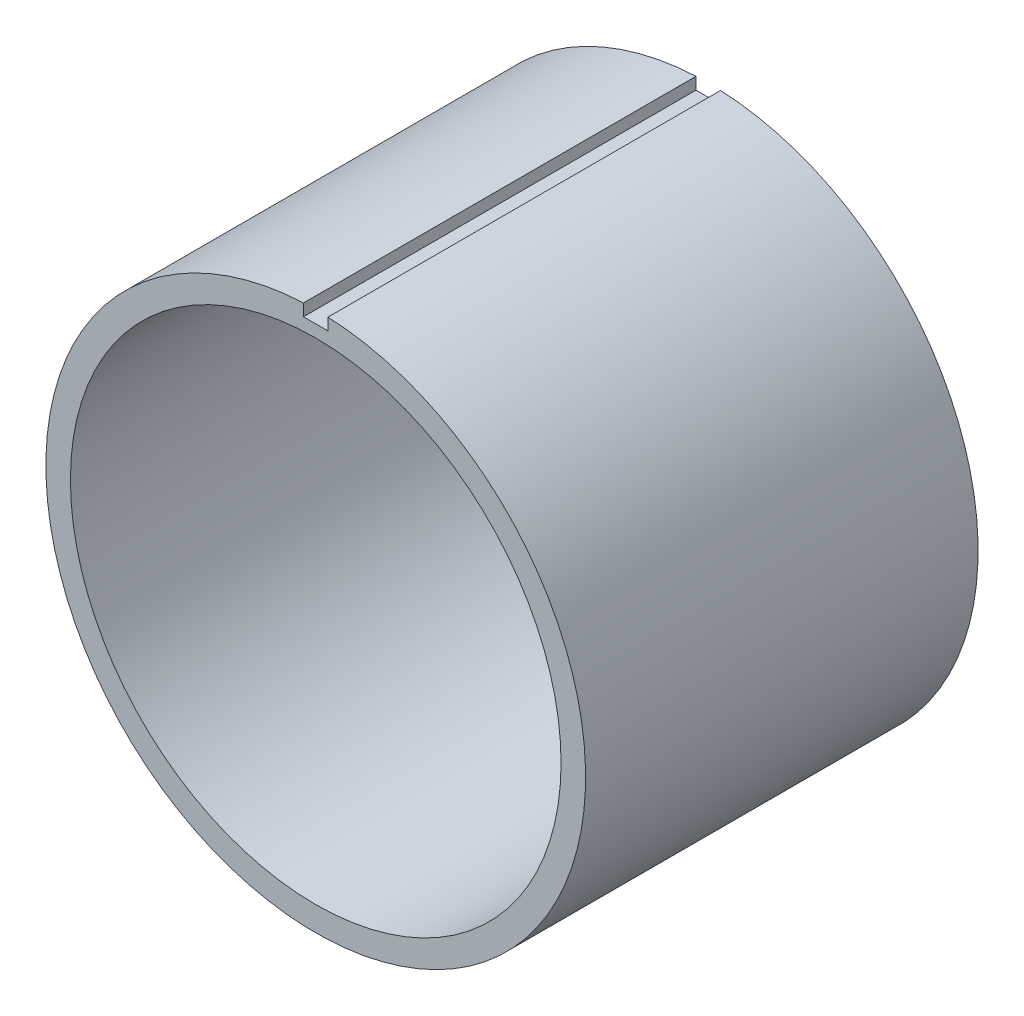
ISO-10303-21;
HEADER;
FILE_DESCRIPTION(('STEP AP214'),'2;1');
FILE_NAME('part.step','',(''),(''),'','','');
FILE_SCHEMA(('AUTOMOTIVE_DESIGN { 1 0 10303 214 1 1 1 1 }'));
ENDSEC;
DATA;
#1=APPLICATION_CONTEXT('core data for automotive mechanical design processes');
#2=APPLICATION_PROTOCOL_DEFINITION('international standard','automotive_design',2000,#1);
#3=PRODUCT_CONTEXT('',#1,'mechanical');
#4=PRODUCT('Part','Part','',(#3));
#5=PRODUCT_RELATED_PRODUCT_CATEGORY('part','',(#4));
#6=PRODUCT_DEFINITION_FORMATION('','',#4);
#7=PRODUCT_DEFINITION_CONTEXT('part definition',#1,'design');
#8=PRODUCT_DEFINITION('design','',#6,#7);
#9=PRODUCT_DEFINITION_SHAPE('','',#8);
#10=(LENGTH_UNIT() NAMED_UNIT(*) SI_UNIT(.MILLI.,.METRE.));
#11=(NAMED_UNIT(*) PLANE_ANGLE_UNIT() SI_UNIT($,.RADIAN.));
#12=(NAMED_UNIT(*) SI_UNIT($,.STERADIAN.) SOLID_ANGLE_UNIT());
#13=UNCERTAINTY_MEASURE_WITH_UNIT(LENGTH_MEASURE(1.E-05),#10,'distance_accuracy_value','');
#14=(GEOMETRIC_REPRESENTATION_CONTEXT(3) GLOBAL_UNCERTAINTY_ASSIGNED_CONTEXT((#13)) GLOBAL_UNIT_ASSIGNED_CONTEXT((#10,
#11,#12)) REPRESENTATION_CONTEXT('',''));
#15=CARTESIAN_POINT('',(0.,0.,0.));
#16=DIRECTION('',(0.,0.,1.));
#17=DIRECTION('',(1.,0.,0.));
#18=AXIS2_PLACEMENT_3D('',#15,#16,#17);
#19=CARTESIAN_POINT('',(-242.141421356237,-2.53629676207876E-12,-10.));
#20=DIRECTION('',(0.,-1.,0.));
#21=DIRECTION('',(1.,0.,0.));
#22=AXIS2_PLACEMENT_3D('',#19,#20,#21);
#23=PLANE('',#22);
#24=DIRECTION('',(1.,0.,0.));
#25=VECTOR('',#24,1.);
#26=CARTESIAN_POINT('',(-242.141421356237,-2.53629676207876E-12,0.));
#27=LINE('',#26,#25);
#28=CARTESIAN_POINT('',(45.,4.71349980743823E-13,0.));
#29=VERTEX_POINT('',#28);
#30=CARTESIAN_POINT('',(100.,1.04744440165294E-12,0.));
#31=VERTEX_POINT('',#30);
#32=EDGE_CURVE('E243',#29,#31,#27,.T.);
#33=ORIENTED_EDGE('',*,*,#32,.F.);
#34=DIRECTION('',(0.,0.,1.));
#35=VECTOR('',#34,1.);
#36=CARTESIAN_POINT('',(45.,4.71349980743823E-13,-10.));
#37=LINE('',#36,#35);
#38=CARTESIAN_POINT('',(45.,4.71349980743823E-13,-10.));
#39=VERTEX_POINT('',#38);
#40=EDGE_CURVE('E13',#39,#29,#37,.T.);
#41=ORIENTED_EDGE('',*,*,#40,.F.);
#42=DIRECTION('',(1.,0.,0.));
#43=VECTOR('',#42,1.);
#44=CARTESIAN_POINT('',(-242.141421356237,-2.53629676207876E-12,-10.));
#45=LINE('',#44,#43);
#46=CARTESIAN_POINT('',(100.,1.04744440165294E-12,-10.));
#47=VERTEX_POINT('',#46);
#48=EDGE_CURVE('E336',#39,#47,#45,.T.);
#49=ORIENTED_EDGE('',*,*,#48,.T.);
#50=DIRECTION('',(0.,0.,1.));
#51=VECTOR('',#50,1.);
#52=CARTESIAN_POINT('',(100.,1.04744440165294E-12,-10.));
#53=LINE('',#52,#51);
#54=EDGE_CURVE('E114',#47,#31,#53,.T.);
#55=ORIENTED_EDGE('',*,*,#54,.T.);
#56=EDGE_LOOP('',(#33,#41,#49,#55));
#57=FACE_BOUND('',#56,.T.);
#58=ADVANCED_FACE('F97',(#57),#23,.T.);
#59=CARTESIAN_POINT('',(0.,0.,-10.));
#60=DIRECTION('',(0.,0.,1.));
#61=DIRECTION('',(1.,0.,0.));
#62=AXIS2_PLACEMENT_3D('',#59,#60,#61);
#63=CYLINDRICAL_SURFACE('',#62,45.);
#64=CARTESIAN_POINT('',(0.,0.,0.));
#65=DIRECTION('',(0.,0.,-1.));
#66=DIRECTION('',(-1.,0.,0.));
#67=AXIS2_PLACEMENT_3D('',#64,#65,#66);
#68=CIRCLE('',#67,45.);
#69=CARTESIAN_POINT('',(5.00000000000032,-44.7213595499958,0.));
#70=VERTEX_POINT('',#69);
#71=EDGE_CURVE('E245',#29,#70,#68,.T.);
#72=ORIENTED_EDGE('',*,*,#71,.T.);
#73=DIRECTION('',(0.,0.,1.));
#74=VECTOR('',#73,1.);
#75=CARTESIAN_POINT('',(5.00000000000032,-44.7213595499958,-10.));
#76=LINE('',#75,#74);
#77=CARTESIAN_POINT('',(5.00000000000032,-44.7213595499958,-10.));
#78=VERTEX_POINT('',#77);
#79=EDGE_CURVE('E106',#78,#70,#76,.T.);
#80=ORIENTED_EDGE('',*,*,#79,.F.);
#81=CARTESIAN_POINT('',(0.,0.,-10.));
#82=DIRECTION('',(0.,0.,-1.));
#83=DIRECTION('',(-1.,0.,0.));
#84=AXIS2_PLACEMENT_3D('',#81,#82,#83);
#85=CIRCLE('',#84,45.);
#86=EDGE_CURVE('E332',#39,#78,#85,.T.);
#87=ORIENTED_EDGE('',*,*,#86,.F.);
#88=ORIENTED_EDGE('',*,*,#40,.T.);
#89=EDGE_LOOP('',(#72,#80,#87,#88));
#90=FACE_BOUND('',#89,.T.);
#91=ADVANCED_FACE('F319',(#90),#63,.T.);
#92=CARTESIAN_POINT('',(5.,1.77049406241722E-12,-10.));
#93=DIRECTION('',(1.,0.,0.));
#94=DIRECTION('',(0.,1.,0.));
#95=AXIS2_PLACEMENT_3D('',#92,#93,#94);
#96=PLANE('',#95);
#97=DIRECTION('',(0.,1.,0.));
#98=VECTOR('',#97,1.);
#99=CARTESIAN_POINT('',(5.,1.77049406241722E-12,0.));
#100=LINE('',#99,#98);
#101=CARTESIAN_POINT('',(5.00000000000071,-99.8749217771909,0.));
#102=VERTEX_POINT('',#101);
#103=EDGE_CURVE('E248',#102,#70,#100,.T.);
#104=ORIENTED_EDGE('',*,*,#103,.F.);
#105=DIRECTION('',(0.,0.,1.));
#106=VECTOR('',#105,1.);
#107=CARTESIAN_POINT('',(5.00000000000071,-99.8749217771909,-10.));
#108=LINE('',#107,#106);
#109=CARTESIAN_POINT('',(5.00000000000071,-99.8749217771909,-10.));
#110=VERTEX_POINT('',#109);
#111=EDGE_CURVE('E309',#110,#102,#108,.T.);
#112=ORIENTED_EDGE('',*,*,#111,.F.);
#113=DIRECTION('',(0.,1.,0.));
#114=VECTOR('',#113,1.);
#115=CARTESIAN_POINT('',(5.,1.77049406241722E-12,-10.));
#116=LINE('',#115,#114);
#117=EDGE_CURVE('E316',#110,#78,#116,.T.);
#118=ORIENTED_EDGE('',*,*,#117,.T.);
#119=ORIENTED_EDGE('',*,*,#79,.T.);
#120=EDGE_LOOP('',(#104,#112,#118,#119));
#121=FACE_BOUND('',#120,.T.);
#122=ADVANCED_FACE('F314',(#121),#96,.T.);
#123=CARTESIAN_POINT('',(-239.489988262978,-105.990996422503,-10.));
#124=DIRECTION('',(0.02500782105754,-0.999687255538428,0.));
#125=DIRECTION('',(0.999687255538428,0.02500782105754,0.));
#126=AXIS2_PLACEMENT_3D('',#123,#124,#125);
#127=PLANE('',#126);
#128=DIRECTION('',(0.999687255538428,0.02500782105754,0.));
#129=VECTOR('',#128,1.);
#130=CARTESIAN_POINT('',(-239.489988262978,-105.990996422503,0.));
#131=LINE('',#130,#129);
#132=CARTESIAN_POINT('',(6.98296267768639E-13,-100.,0.));
#133=VERTEX_POINT('',#132);
#134=EDGE_CURVE('E251',#133,#102,#131,.T.);
#135=ORIENTED_EDGE('',*,*,#134,.F.);
#136=DIRECTION('',(0.,0.,1.));
#137=VECTOR('',#136,1.);
#138=CARTESIAN_POINT('',(6.98296267768639E-13,-100.,-10.));
#139=LINE('',#138,#137);
#140=CARTESIAN_POINT('',(6.98296267768639E-13,-100.,-10.));
#141=VERTEX_POINT('',#140);
#142=EDGE_CURVE('E307',#141,#133,#139,.T.);
#143=ORIENTED_EDGE('',*,*,#142,.F.);
#144=DIRECTION('',(0.999687255538428,0.02500782105754,0.));
#145=VECTOR('',#144,1.);
#146=CARTESIAN_POINT('',(-239.489988262978,-105.990996422503,-10.));
#147=LINE('',#146,#145);
#148=EDGE_CURVE('E329',#141,#110,#147,.T.);
#149=ORIENTED_EDGE('',*,*,#148,.T.);
#150=ORIENTED_EDGE('',*,*,#111,.T.);
#151=EDGE_LOOP('',(#135,#143,#149,#150));
#152=FACE_BOUND('',#151,.T.);
#153=ADVANCED_FACE('F326',(#152),#127,.T.);
#154=CARTESIAN_POINT('',(0.,1.71424690635048E-12,-10.));
#155=DIRECTION('',(-1.,0.,0.));
#156=DIRECTION('',(0.,-1.,0.));
#157=AXIS2_PLACEMENT_3D('',#154,#155,#156);
#158=PLANE('',#157);
#159=DIRECTION('',(0.,-1.,0.));
#160=VECTOR('',#159,1.);
#161=CARTESIAN_POINT('',(0.,1.71424690635048E-12,0.));
#162=LINE('',#161,#160);
#163=CARTESIAN_POINT('',(3.14233320495894E-13,-45.,0.));
#164=VERTEX_POINT('',#163);
#165=EDGE_CURVE('E254',#164,#133,#162,.T.);
#166=ORIENTED_EDGE('',*,*,#165,.F.);
#167=DIRECTION('',(0.,0.,1.));
#168=VECTOR('',#167,1.);
#169=CARTESIAN_POINT('',(3.14233320495894E-13,-45.,-10.));
#170=LINE('',#169,#168);
#171=CARTESIAN_POINT('',(3.14233320495894E-13,-45.,-10.));
#172=VERTEX_POINT('',#171);
#173=EDGE_CURVE('E305',#172,#164,#170,.T.);
#174=ORIENTED_EDGE('',*,*,#173,.F.);
#175=DIRECTION('',(0.,-1.,0.));
#176=VECTOR('',#175,1.);
#177=CARTESIAN_POINT('',(0.,1.71424690635048E-12,-10.));
#178=LINE('',#177,#176);
#179=EDGE_CURVE('E334',#172,#141,#178,.T.);
#180=ORIENTED_EDGE('',*,*,#179,.T.);
#181=ORIENTED_EDGE('',*,*,#142,.T.);
#182=EDGE_LOOP('',(#166,#174,#180,#181));
#183=FACE_BOUND('',#182,.T.);
#184=ADVANCED_FACE('F385',(#183),#158,.T.);
#185=CARTESIAN_POINT('',(0.,0.,-10.));
#186=DIRECTION('',(0.,0.,1.));
#187=DIRECTION('',(1.,0.,0.));
#188=AXIS2_PLACEMENT_3D('',#185,#186,#187);
#189=CYLINDRICAL_SURFACE('',#188,45.);
#190=CARTESIAN_POINT('',(0.,0.,0.));
#191=DIRECTION('',(0.,0.,-1.));
#192=DIRECTION('',(-1.,0.,0.));
#193=AXIS2_PLACEMENT_3D('',#190,#191,#192);
#194=CIRCLE('',#193,45.);
#195=CARTESIAN_POINT('',(-44.7213595499958,-5.00000000000015,0.));
#196=VERTEX_POINT('',#195);
#197=EDGE_CURVE('E257',#164,#196,#194,.T.);
#198=ORIENTED_EDGE('',*,*,#197,.T.);
#199=DIRECTION('',(0.,0.,1.));
#200=VECTOR('',#199,1.);
#201=CARTESIAN_POINT('',(-44.7213595499958,-5.00000000000015,-10.));
#202=LINE('',#201,#200);
#203=CARTESIAN_POINT('',(-44.7213595499958,-5.00000000000015,-10.));
#204=VERTEX_POINT('',#203);
#205=EDGE_CURVE('E303',#204,#196,#202,.T.);
#206=ORIENTED_EDGE('',*,*,#205,.F.);
#207=CARTESIAN_POINT('',(0.,0.,-10.));
#208=DIRECTION('',(0.,0.,-1.));
#209=DIRECTION('',(-1.,0.,0.));
#210=AXIS2_PLACEMENT_3D('',#207,#208,#209);
#211=CIRCLE('',#210,45.);
#212=EDGE_CURVE('E341',#172,#204,#211,.T.);
#213=ORIENTED_EDGE('',*,*,#212,.F.);
#214=ORIENTED_EDGE('',*,*,#173,.T.);
#215=EDGE_LOOP('',(#198,#206,#213,#214));
#216=FACE_BOUND('',#215,.T.);
#217=ADVANCED_FACE('F388',(#216),#189,.T.);
#218=CARTESIAN_POINT('',(-242.141421356237,-5.00000000000086,-10.));
#219=DIRECTION('',(0.,-1.,0.));
#220=DIRECTION('',(1.,0.,0.));
#221=AXIS2_PLACEMENT_3D('',#218,#219,#220);
#222=PLANE('',#221);
#223=DIRECTION('',(1.,0.,0.));
#224=VECTOR('',#223,1.);
#225=CARTESIAN_POINT('',(-242.141421356237,-5.00000000000086,0.));
#226=LINE('',#225,#224);
#227=CARTESIAN_POINT('',(-99.8749217771909,-5.00000000000035,0.));
#228=VERTEX_POINT('',#227);
#229=EDGE_CURVE('E260',#228,#196,#226,.T.);
#230=ORIENTED_EDGE('',*,*,#229,.F.);
#231=DIRECTION('',(0.,0.,1.));
#232=VECTOR('',#231,1.);
#233=CARTESIAN_POINT('',(-99.8749217771909,-5.00000000000035,-10.));
#234=LINE('',#233,#232);
#235=CARTESIAN_POINT('',(-99.8749217771909,-5.00000000000035,-10.));
#236=VERTEX_POINT('',#235);
#237=EDGE_CURVE('E301',#236,#228,#234,.T.);
#238=ORIENTED_EDGE('',*,*,#237,.F.);
#239=DIRECTION('',(1.,0.,0.));
#240=VECTOR('',#239,1.);
#241=CARTESIAN_POINT('',(-242.141421356237,-5.00000000000086,-10.));
#242=LINE('',#241,#240);
#243=EDGE_CURVE('E343',#236,#204,#242,.T.);
#244=ORIENTED_EDGE('',*,*,#243,.T.);
#245=ORIENTED_EDGE('',*,*,#205,.T.);
#246=EDGE_LOOP('',(#230,#238,#244,#245));
#247=FACE_BOUND('',#246,.T.);
#248=ADVANCED_FACE('F392',(#247),#222,.T.);
#249=CARTESIAN_POINT('',(-100.088893981854,3.55353553390634,-10.));
#250=DIRECTION('',(-0.999687255538428,-0.0250078210575345,0.));
#251=DIRECTION('',(0.0250078210575345,-0.999687255538428,0.));
#252=AXIS2_PLACEMENT_3D('',#249,#250,#251);
#253=PLANE('',#252);
#254=DIRECTION('',(0.0250078210575345,-0.999687255538428,0.));
#255=VECTOR('',#254,1.);
#256=CARTESIAN_POINT('',(-100.088893981854,3.55353553390634,0.));
#257=LINE('',#256,#255);
#258=CARTESIAN_POINT('',(-100.,-3.49148133884313E-13,0.));
#259=VERTEX_POINT('',#258);
#260=EDGE_CURVE('E263',#259,#228,#257,.T.);
#261=ORIENTED_EDGE('',*,*,#260,.F.);
#262=DIRECTION('',(0.,0.,1.));
#263=VECTOR('',#262,1.);
#264=CARTESIAN_POINT('',(-100.,-3.49148133884313E-13,-10.));
#265=LINE('',#264,#263);
#266=CARTESIAN_POINT('',(-100.,-3.49148133884313E-13,-10.));
#267=VERTEX_POINT('',#266);
#268=EDGE_CURVE('E299',#267,#259,#265,.T.);
#269=ORIENTED_EDGE('',*,*,#268,.F.);
#270=DIRECTION('',(0.0250078210575345,-0.999687255538428,0.));
#271=VECTOR('',#270,1.);
#272=CARTESIAN_POINT('',(-100.088893981854,3.55353553390634,-10.));
#273=LINE('',#272,#271);
#274=EDGE_CURVE('E346',#267,#236,#273,.T.);
#275=ORIENTED_EDGE('',*,*,#274,.T.);
#276=ORIENTED_EDGE('',*,*,#237,.T.);
#277=EDGE_LOOP('',(#261,#269,#275,#276));
#278=FACE_BOUND('',#277,.T.);
#279=ADVANCED_FACE('F396',(#278),#253,.T.);
#280=CARTESIAN_POINT('',(-242.141421356237,-8.45432254026255E-13,-10.));
#281=DIRECTION('',(0.,1.,0.));
#282=DIRECTION('',(-1.,0.,0.));
#283=AXIS2_PLACEMENT_3D('',#280,#281,#282);
#284=PLANE('',#283);
#285=DIRECTION('',(-1.,0.,0.));
#286=VECTOR('',#285,1.);
#287=CARTESIAN_POINT('',(-242.141421356237,-8.45432254026255E-13,0.));
#288=LINE('',#287,#286);
#289=CARTESIAN_POINT('',(-45.,-1.57116660247941E-13,0.));
#290=VERTEX_POINT('',#289);
#291=EDGE_CURVE('E266',#290,#259,#288,.T.);
#292=ORIENTED_EDGE('',*,*,#291,.F.);
#293=DIRECTION('',(0.,0.,1.));
#294=VECTOR('',#293,1.);
#295=CARTESIAN_POINT('',(-45.,-1.57116660247941E-13,-10.));
#296=LINE('',#295,#294);
#297=CARTESIAN_POINT('',(-45.,-1.57116660247941E-13,-10.));
#298=VERTEX_POINT('',#297);
#299=EDGE_CURVE('E297',#298,#290,#296,.T.);
#300=ORIENTED_EDGE('',*,*,#299,.F.);
#301=DIRECTION('',(-1.,0.,0.));
#302=VECTOR('',#301,1.);
#303=CARTESIAN_POINT('',(-242.141421356237,-8.45432254026255E-13,-10.));
#304=LINE('',#303,#302);
#305=EDGE_CURVE('E349',#298,#267,#304,.T.);
#306=ORIENTED_EDGE('',*,*,#305,.T.);
#307=ORIENTED_EDGE('',*,*,#268,.T.);
#308=EDGE_LOOP('',(#292,#300,#306,#307));
#309=FACE_BOUND('',#308,.T.);
#310=ADVANCED_FACE('F400',(#309),#284,.T.);
#311=CARTESIAN_POINT('',(0.,0.,-10.));
#312=DIRECTION('',(0.,0.,1.));
#313=DIRECTION('',(1.,0.,0.));
#314=AXIS2_PLACEMENT_3D('',#311,#312,#313);
#315=CYLINDRICAL_SURFACE('',#314,45.);
#316=CARTESIAN_POINT('',(0.,0.,0.));
#317=DIRECTION('',(0.,0.,-1.));
#318=DIRECTION('',(-1.,0.,0.));
#319=AXIS2_PLACEMENT_3D('',#316,#317,#318);
#320=CIRCLE('',#319,45.);
#321=CARTESIAN_POINT('',(-5.00000000000001,44.7213595499958,0.));
#322=VERTEX_POINT('',#321);
#323=EDGE_CURVE('E269',#290,#322,#320,.T.);
#324=ORIENTED_EDGE('',*,*,#323,.T.);
#325=DIRECTION('',(0.,0.,1.));
#326=VECTOR('',#325,1.);
#327=CARTESIAN_POINT('',(-5.00000000000001,44.7213595499958,-10.));
#328=LINE('',#327,#326);
#329=CARTESIAN_POINT('',(-5.00000000000001,44.7213595499958,-10.));
#330=VERTEX_POINT('',#329);
#331=EDGE_CURVE('E295',#330,#322,#328,.T.);
#332=ORIENTED_EDGE('',*,*,#331,.F.);
#333=CARTESIAN_POINT('',(0.,0.,-10.));
#334=DIRECTION('',(0.,0.,-1.));
#335=DIRECTION('',(-1.,0.,0.));
#336=AXIS2_PLACEMENT_3D('',#333,#334,#335);
#337=CIRCLE('',#336,45.);
#338=EDGE_CURVE('E352',#298,#330,#337,.T.);
#339=ORIENTED_EDGE('',*,*,#338,.F.);
#340=ORIENTED_EDGE('',*,*,#299,.T.);
#341=EDGE_LOOP('',(#324,#332,#339,#340));
#342=FACE_BOUND('',#341,.T.);
#343=ADVANCED_FACE('F404',(#342),#315,.T.);
#344=CARTESIAN_POINT('',(-5.,0.,-10.));
#345=DIRECTION('',(-1.,0.,0.));
#346=DIRECTION('',(0.,-1.,0.));
#347=AXIS2_PLACEMENT_3D('',#344,#345,#346);
#348=PLANE('',#347);
#349=DIRECTION('',(0.,-1.,0.));
#350=VECTOR('',#349,1.);
#351=CARTESIAN_POINT('',(-5.,0.,0.));
#352=LINE('',#351,#350);
#353=CARTESIAN_POINT('',(-5.00000000000048,99.8749217771909,0.));
#354=VERTEX_POINT('',#353);
#355=EDGE_CURVE('E272',#354,#322,#352,.T.);
#356=ORIENTED_EDGE('',*,*,#355,.F.);
#357=DIRECTION('',(0.,0.,1.));
#358=VECTOR('',#357,1.);
#359=CARTESIAN_POINT('',(-5.00000000000048,99.8749217771909,-10.));
#360=LINE('',#359,#358);
#361=CARTESIAN_POINT('',(-5.00000000000048,99.8749217771909,-10.));
#362=VERTEX_POINT('',#361);
#363=EDGE_CURVE('E293',#362,#354,#360,.T.);
#364=ORIENTED_EDGE('',*,*,#363,.F.);
#365=DIRECTION('',(0.,-1.,0.));
#366=VECTOR('',#365,1.);
#367=CARTESIAN_POINT('',(-5.,0.,-10.));
#368=LINE('',#367,#366);
#369=EDGE_CURVE('E354',#362,#330,#368,.T.);
#370=ORIENTED_EDGE('',*,*,#369,.T.);
#371=ORIENTED_EDGE('',*,*,#331,.T.);
#372=EDGE_LOOP('',(#356,#364,#370,#371));
#373=FACE_BOUND('',#372,.T.);
#374=ADVANCED_FACE('F408',(#373),#348,.T.);
#375=CARTESIAN_POINT('',(-244.489988262979,93.8839253546895,-10.));
#376=DIRECTION('',(-0.0250078210575317,0.999687255538428,0.));
#377=DIRECTION('',(-0.999687255538428,-0.0250078210575317,0.));
#378=AXIS2_PLACEMENT_3D('',#375,#376,#377);
#379=PLANE('',#378);
#380=DIRECTION('',(-0.999687255538428,-0.0250078210575317,0.));
#381=VECTOR('',#380,1.);
#382=CARTESIAN_POINT('',(-244.489988262979,93.8839253546895,0.));
#383=LINE('',#382,#381);
#384=CARTESIAN_POINT('',(0.,100.,0.));
#385=VERTEX_POINT('',#384);
#386=EDGE_CURVE('E275',#385,#354,#383,.T.);
#387=ORIENTED_EDGE('',*,*,#386,.F.);
#388=DIRECTION('',(0.,0.,1.));
#389=VECTOR('',#388,1.);
#390=CARTESIAN_POINT('',(0.,100.,-10.));
#391=LINE('',#390,#389);
#392=CARTESIAN_POINT('',(0.,100.,-10.));
#393=VERTEX_POINT('',#392);
#394=EDGE_CURVE('E291',#393,#385,#391,.T.);
#395=ORIENTED_EDGE('',*,*,#394,.F.);
#396=DIRECTION('',(-0.999687255538428,-0.0250078210575317,0.));
#397=VECTOR('',#396,1.);
#398=CARTESIAN_POINT('',(-244.489988262979,93.8839253546895,-10.));
#399=LINE('',#398,#397);
#400=EDGE_CURVE('E357',#393,#362,#399,.T.);
#401=ORIENTED_EDGE('',*,*,#400,.T.);
#402=ORIENTED_EDGE('',*,*,#363,.T.);
#403=EDGE_LOOP('',(#387,#395,#401,#402));
#404=FACE_BOUND('',#403,.T.);
#405=ADVANCED_FACE('F412',(#404),#379,.T.);
#406=CARTESIAN_POINT('',(0.,0.,-10.));
#407=DIRECTION('',(1.,0.,0.));
#408=DIRECTION('',(0.,0.,-1.));
#409=AXIS2_PLACEMENT_3D('',#406,#407,#408);
#410=PLANE('',#409);
#411=DIRECTION('',(0.,1.,0.));
#412=VECTOR('',#411,1.);
#413=CARTESIAN_POINT('',(0.,0.,0.));
#414=LINE('',#413,#412);
#415=CARTESIAN_POINT('',(0.,45.,0.));
#416=VERTEX_POINT('',#415);
#417=EDGE_CURVE('E278',#416,#385,#414,.T.);
#418=ORIENTED_EDGE('',*,*,#417,.F.);
#419=DIRECTION('',(0.,0.,1.));
#420=VECTOR('',#419,1.);
#421=CARTESIAN_POINT('',(0.,45.,-10.));
#422=LINE('',#421,#420);
#423=CARTESIAN_POINT('',(0.,45.,-10.));
#424=VERTEX_POINT('',#423);
#425=EDGE_CURVE('E232',#424,#416,#422,.T.);
#426=ORIENTED_EDGE('',*,*,#425,.F.);
#427=DIRECTION('',(0.,1.,0.));
#428=VECTOR('',#427,1.);
#429=CARTESIAN_POINT('',(0.,0.,-10.));
#430=LINE('',#429,#428);
#431=EDGE_CURVE('E222',#424,#393,#430,.T.);
#432=ORIENTED_EDGE('',*,*,#431,.T.);
#433=ORIENTED_EDGE('',*,*,#394,.T.);
#434=EDGE_LOOP('',(#418,#426,#432,#433));
#435=FACE_BOUND('',#434,.T.);
#436=ADVANCED_FACE('F361',(#435),#410,.T.);
#437=CARTESIAN_POINT('',(0.,0.,-10.));
#438=DIRECTION('',(0.,0.,1.));
#439=DIRECTION('',(1.,0.,0.));
#440=AXIS2_PLACEMENT_3D('',#437,#438,#439);
#441=CYLINDRICAL_SURFACE('',#440,45.);
#442=CARTESIAN_POINT('',(0.,0.,0.));
#443=DIRECTION('',(0.,0.,-1.));
#444=DIRECTION('',(-1.,0.,0.));
#445=AXIS2_PLACEMENT_3D('',#442,#443,#444);
#446=CIRCLE('',#445,45.);
#447=CARTESIAN_POINT('',(44.7213595499957,5.00000000000046,0.));
#448=VERTEX_POINT('',#447);
#449=EDGE_CURVE('E229',#416,#448,#446,.T.);
#450=ORIENTED_EDGE('',*,*,#449,.T.);
#451=DIRECTION('',(0.,0.,1.));
#452=VECTOR('',#451,1.);
#453=CARTESIAN_POINT('',(44.7213595499957,5.00000000000046,-10.));
#454=LINE('',#453,#452);
#455=CARTESIAN_POINT('',(44.7213595499957,5.00000000000046,-10.));
#456=VERTEX_POINT('',#455);
#457=EDGE_CURVE('E226',#456,#448,#454,.T.);
#458=ORIENTED_EDGE('',*,*,#457,.F.);
#459=CARTESIAN_POINT('',(0.,0.,-10.));
#460=DIRECTION('',(0.,0.,-1.));
#461=DIRECTION('',(-1.,0.,0.));
#462=AXIS2_PLACEMENT_3D('',#459,#460,#461);
#463=CIRCLE('',#462,45.);
#464=EDGE_CURVE('E213',#424,#456,#463,.T.);
#465=ORIENTED_EDGE('',*,*,#464,.F.);
#466=ORIENTED_EDGE('',*,*,#425,.T.);
#467=EDGE_LOOP('',(#450,#458,#465,#466));
#468=FACE_BOUND('',#467,.T.);
#469=ADVANCED_FACE('F227',(#468),#441,.T.);
#470=CARTESIAN_POINT('',(-242.141421356237,4.99999999999743,-10.));
#471=DIRECTION('',(0.,1.,0.));
#472=DIRECTION('',(-1.,0.,0.));
#473=AXIS2_PLACEMENT_3D('',#470,#471,#472);
#474=PLANE('',#473);
#475=DIRECTION('',(-1.,0.,0.));
#476=VECTOR('',#475,1.);
#477=CARTESIAN_POINT('',(-242.141421356237,4.99999999999743,0.));
#478=LINE('',#477,#476);
#479=CARTESIAN_POINT('',(99.8749217771908,5.00000000000105,0.));
#480=VERTEX_POINT('',#479);
#481=EDGE_CURVE('E282',#480,#448,#478,.T.);
#482=ORIENTED_EDGE('',*,*,#481,.F.);
#483=DIRECTION('',(0.,0.,1.));
#484=VECTOR('',#483,1.);
#485=CARTESIAN_POINT('',(99.8749217771908,5.00000000000105,-10.));
#486=LINE('',#485,#484);
#487=CARTESIAN_POINT('',(99.8749217771908,5.00000000000105,-10.));
#488=VERTEX_POINT('',#487);
#489=EDGE_CURVE('E163',#488,#480,#486,.T.);
#490=ORIENTED_EDGE('',*,*,#489,.F.);
#491=DIRECTION('',(-1.,0.,0.));
#492=VECTOR('',#491,1.);
#493=CARTESIAN_POINT('',(-242.141421356237,4.99999999999743,-10.));
#494=LINE('',#493,#492);
#495=EDGE_CURVE('E219',#488,#456,#494,.T.);
#496=ORIENTED_EDGE('',*,*,#495,.T.);
#497=ORIENTED_EDGE('',*,*,#457,.T.);
#498=EDGE_LOOP('',(#482,#490,#496,#497));
#499=FACE_BOUND('',#498,.T.);
#500=ADVANCED_FACE('F234',(#499),#474,.T.);
#501=CARTESIAN_POINT('',(0.,0.,-10.));
#502=DIRECTION('',(0.,0.,1.));
#503=DIRECTION('',(1.,0.,0.));
#504=AXIS2_PLACEMENT_3D('',#501,#502,#503);
#505=CYLINDRICAL_SURFACE('',#504,40.);
#506=CARTESIAN_POINT('',(0.,0.,-10.));
#507=DIRECTION('',(0.,0.,-1.));
#508=DIRECTION('',(-1.,0.,0.));
#509=AXIS2_PLACEMENT_3D('',#506,#507,#508);
#510=CIRCLE('',#509,40.);
#511=CARTESIAN_POINT('',(-40.,0.,-10.));
#512=VERTEX_POINT('',#511);
#513=EDGE_CURVE('E287',#512,#512,#510,.T.);
#514=ORIENTED_EDGE('',*,*,#513,.T.);
#515=EDGE_LOOP('',(#514));
#516=FACE_BOUND('',#515,.T.);
#517=CARTESIAN_POINT('',(0.,0.,0.));
#518=DIRECTION('',(0.,0.,-1.));
#519=DIRECTION('',(-1.,0.,0.));
#520=AXIS2_PLACEMENT_3D('',#517,#518,#519);
#521=CIRCLE('',#520,40.);
#522=CARTESIAN_POINT('',(-40.,0.,0.));
#523=VERTEX_POINT('',#522);
#524=EDGE_CURVE('E240',#523,#523,#521,.T.);
#525=ORIENTED_EDGE('',*,*,#524,.F.);
#526=EDGE_LOOP('',(#525));
#527=FACE_BOUND('',#526,.T.);
#528=ADVANCED_FACE('F99',(#516,#527),#505,.F.);
#529=CARTESIAN_POINT('',(99.7860277953367,8.55353553390973,-10.));
#530=DIRECTION('',(0.999687255538428,0.0250078210575428,0.));
#531=DIRECTION('',(-0.0250078210575428,0.999687255538428,0.));
#532=AXIS2_PLACEMENT_3D('',#529,#530,#531);
#533=PLANE('',#532);
#534=DIRECTION('',(-0.0250078210575428,0.999687255538428,0.));
#535=VECTOR('',#534,1.);
#536=CARTESIAN_POINT('',(99.7860277953367,8.55353553390973,0.));
#537=LINE('',#536,#535);
#538=EDGE_CURVE('E284',#31,#480,#537,.T.);
#539=ORIENTED_EDGE('',*,*,#538,.F.);
#540=ORIENTED_EDGE('',*,*,#54,.F.);
#541=DIRECTION('',(-0.0250078210575428,0.999687255538428,0.));
#542=VECTOR('',#541,1.);
#543=CARTESIAN_POINT('',(99.7860277953367,8.55353553390973,-10.));
#544=LINE('',#543,#542);
#545=EDGE_CURVE('E235',#47,#488,#544,.T.);
#546=ORIENTED_EDGE('',*,*,#545,.T.);
#547=ORIENTED_EDGE('',*,*,#489,.T.);
#548=EDGE_LOOP('',(#539,#540,#546,#547));
#549=FACE_BOUND('',#548,.T.);
#550=ADVANCED_FACE('F363',(#549),#533,.T.);
#551=CARTESIAN_POINT('',(-242.141421356237,0.,-10.));
#552=DIRECTION('',(0.,0.,-1.));
#553=DIRECTION('',(-1.,0.,0.));
#554=AXIS2_PLACEMENT_3D('',#551,#552,#553);
#555=PLANE('',#554);
#556=ORIENTED_EDGE('',*,*,#513,.F.);
#557=EDGE_LOOP('',(#556));
#558=FACE_BOUND('',#557,.T.);
#559=ORIENTED_EDGE('',*,*,#48,.F.);
#560=ORIENTED_EDGE('',*,*,#86,.T.);
#561=ORIENTED_EDGE('',*,*,#117,.F.);
#562=ORIENTED_EDGE('',*,*,#148,.F.);
#563=ORIENTED_EDGE('',*,*,#179,.F.);
#564=ORIENTED_EDGE('',*,*,#212,.T.);
#565=ORIENTED_EDGE('',*,*,#243,.F.);
#566=ORIENTED_EDGE('',*,*,#274,.F.);
#567=ORIENTED_EDGE('',*,*,#305,.F.);
#568=ORIENTED_EDGE('',*,*,#338,.T.);
#569=ORIENTED_EDGE('',*,*,#369,.F.);
#570=ORIENTED_EDGE('',*,*,#400,.F.);
#571=ORIENTED_EDGE('',*,*,#431,.F.);
#572=ORIENTED_EDGE('',*,*,#464,.T.);
#573=ORIENTED_EDGE('',*,*,#495,.F.);
#574=ORIENTED_EDGE('',*,*,#545,.F.);
#575=EDGE_LOOP('',(#559,#560,#561,#562,#563,#564,#565,#566,#567,#568,#569,#570,#571,#572,#573,#574));
#576=FACE_BOUND('',#575,.T.);
#577=ADVANCED_FACE('F216',(#558,#576),#555,.T.);
#578=CARTESIAN_POINT('',(-242.141421356237,0.,0.));
#579=DIRECTION('',(0.,0.,-1.));
#580=DIRECTION('',(-1.,0.,0.));
#581=AXIS2_PLACEMENT_3D('',#578,#579,#580);
#582=PLANE('',#581);
#583=ORIENTED_EDGE('',*,*,#524,.T.);
#584=EDGE_LOOP('',(#583));
#585=FACE_BOUND('',#584,.T.);
#586=ORIENTED_EDGE('',*,*,#32,.T.);
#587=ORIENTED_EDGE('',*,*,#538,.T.);
#588=ORIENTED_EDGE('',*,*,#481,.T.);
#589=ORIENTED_EDGE('',*,*,#449,.F.);
#590=ORIENTED_EDGE('',*,*,#417,.T.);
#591=ORIENTED_EDGE('',*,*,#386,.T.);
#592=ORIENTED_EDGE('',*,*,#355,.T.);
#593=ORIENTED_EDGE('',*,*,#323,.F.);
#594=ORIENTED_EDGE('',*,*,#291,.T.);
#595=ORIENTED_EDGE('',*,*,#260,.T.);
#596=ORIENTED_EDGE('',*,*,#229,.T.);
#597=ORIENTED_EDGE('',*,*,#197,.F.);
#598=ORIENTED_EDGE('',*,*,#165,.T.);
#599=ORIENTED_EDGE('',*,*,#134,.T.);
#600=ORIENTED_EDGE('',*,*,#103,.T.);
#601=ORIENTED_EDGE('',*,*,#71,.F.);
#602=EDGE_LOOP('',(#586,#587,#588,#589,#590,#591,#592,#593,#594,#595,#596,#597,#598,#599,#600,#601));
#603=FACE_BOUND('',#602,.T.);
#604=ADVANCED_FACE('F321',(#585,#603),#582,.F.);
#605=CLOSED_SHELL('',(#58,#91,#122,#153,#184,#217,#248,#279,#310,#343,#374,#405,#436,#469,#500,
#528,#550,#577,#604));
#606=MANIFOLD_SOLID_BREP('B2',#605);
#607=CARTESIAN_POINT('',(0.,0.,150.));
#608=DIRECTION('',(0.,0.,1.));
#609=DIRECTION('',(1.,0.,0.));
#610=AXIS2_PLACEMENT_3D('',#607,#608,#609);
#611=PLANE('',#610);
#612=CARTESIAN_POINT('',(0.,0.,150.));
#613=DIRECTION('',(0.,0.,1.));
#614=DIRECTION('',(1.,0.,0.));
#615=AXIS2_PLACEMENT_3D('',#612,#613,#614);
#616=CIRCLE('',#615,100.);
#617=CARTESIAN_POINT('',(100.,0.,150.));
#618=VERTEX_POINT('',#617);
#619=EDGE_CURVE('E656',#618,#618,#616,.T.);
#620=ORIENTED_EDGE('',*,*,#619,.F.);
#621=EDGE_LOOP('',(#620));
#622=FACE_BOUND('',#621,.T.);
#623=CARTESIAN_POINT('',(0.,0.,150.));
#624=DIRECTION('',(0.,0.,1.));
#625=DIRECTION('',(1.,0.,0.));
#626=AXIS2_PLACEMENT_3D('',#623,#624,#625);
#627=CIRCLE('',#626,110.);
#628=CARTESIAN_POINT('',(-5.00000000000002,109.88630487918,150.));
#629=VERTEX_POINT('',#628);
#630=CARTESIAN_POINT('',(4.99999999999996,109.88630487918,150.));
#631=VERTEX_POINT('',#630);
#632=EDGE_CURVE('E654',#629,#631,#627,.T.);
#633=ORIENTED_EDGE('',*,*,#632,.T.);
#634=DIRECTION('',(0.,-1.,0.));
#635=VECTOR('',#634,1.);
#636=CARTESIAN_POINT('',(4.99999999999996,115.,150.));
#637=LINE('',#636,#635);
#638=CARTESIAN_POINT('',(4.99999999999996,105.,150.));
#639=VERTEX_POINT('',#638);
#640=EDGE_CURVE('E617',#631,#639,#637,.T.);
#641=ORIENTED_EDGE('',*,*,#640,.T.);
#642=DIRECTION('',(1.,0.,0.));
#643=VECTOR('',#642,1.);
#644=CARTESIAN_POINT('',(4.99999999999996,105.,150.));
#645=LINE('',#644,#643);
#646=CARTESIAN_POINT('',(-5.00000000000002,105.,150.));
#647=VERTEX_POINT('',#646);
#648=EDGE_CURVE('E648',#647,#639,#645,.T.);
#649=ORIENTED_EDGE('',*,*,#648,.F.);
#650=DIRECTION('',(0.,-1.,0.));
#651=VECTOR('',#650,1.);
#652=CARTESIAN_POINT('',(-5.00000000000002,115.,150.));
#653=LINE('',#652,#651);
#654=EDGE_CURVE('E647',#629,#647,#653,.T.);
#655=ORIENTED_EDGE('',*,*,#654,.F.);
#656=EDGE_LOOP('',(#633,#641,#649,#655));
#657=FACE_BOUND('',#656,.T.);
#658=ADVANCED_FACE('F595',(#622,#657),#611,.T.);
#659=CARTESIAN_POINT('',(0.,0.,150.));
#660=DIRECTION('',(0.,0.,-1.));
#661=DIRECTION('',(-1.,0.,0.));
#662=AXIS2_PLACEMENT_3D('',#659,#660,#661);
#663=CYLINDRICAL_SURFACE('',#662,110.);
#664=DIRECTION('',(0.,0.,-1.));
#665=VECTOR('',#664,1.);
#666=CARTESIAN_POINT('',(4.99999999999996,109.88630487918,150.));
#667=LINE('',#666,#665);
#668=CARTESIAN_POINT('',(4.99999999999996,109.88630487918,-10.));
#669=VERTEX_POINT('',#668);
#670=EDGE_CURVE('E665',#631,#669,#667,.T.);
#671=ORIENTED_EDGE('',*,*,#670,.F.);
#672=ORIENTED_EDGE('',*,*,#632,.F.);
#673=DIRECTION('',(0.,0.,-1.));
#674=VECTOR('',#673,1.);
#675=CARTESIAN_POINT('',(-5.00000000000002,109.88630487918,150.));
#676=LINE('',#675,#674);
#677=CARTESIAN_POINT('',(-5.00000000000004,109.88630487918,-10.));
#678=VERTEX_POINT('',#677);
#679=EDGE_CURVE('E667',#678,#629,#676,.F.);
#680=ORIENTED_EDGE('',*,*,#679,.F.);
#681=CARTESIAN_POINT('',(0.,0.,-10.));
#682=DIRECTION('',(0.,0.,-1.));
#683=DIRECTION('',(-1.,0.,0.));
#684=AXIS2_PLACEMENT_3D('',#681,#682,#683);
#685=CIRCLE('',#684,110.);
#686=EDGE_CURVE('E653',#669,#678,#685,.T.);
#687=ORIENTED_EDGE('',*,*,#686,.F.);
#688=EDGE_LOOP('',(#671,#672,#680,#687));
#689=FACE_BOUND('',#688,.T.);
#690=ADVANCED_FACE('F597',(#689),#663,.T.);
#691=CARTESIAN_POINT('',(-242.141421356237,0.,-10.));
#692=DIRECTION('',(0.,0.,-1.));
#693=DIRECTION('',(-1.,0.,0.));
#694=AXIS2_PLACEMENT_3D('',#691,#692,#693);
#695=PLANE('',#694);
#696=CARTESIAN_POINT('',(0.,0.,-10.));
#697=DIRECTION('',(0.,0.,-1.));
#698=DIRECTION('',(-1.,0.,0.));
#699=AXIS2_PLACEMENT_3D('',#696,#697,#698);
#700=CIRCLE('',#699,100.);
#701=CARTESIAN_POINT('',(-100.,0.,-10.));
#702=VERTEX_POINT('',#701);
#703=EDGE_CURVE('E662',#702,#702,#700,.F.);
#704=ORIENTED_EDGE('',*,*,#703,.T.);
#705=EDGE_LOOP('',(#704));
#706=FACE_BOUND('',#705,.T.);
#707=DIRECTION('',(-1.,0.,0.));
#708=VECTOR('',#707,1.);
#709=CARTESIAN_POINT('',(-5.00000000000004,105.,-10.));
#710=LINE('',#709,#708);
#711=CARTESIAN_POINT('',(4.99999999999995,105.,-10.));
#712=VERTEX_POINT('',#711);
#713=CARTESIAN_POINT('',(-5.00000000000004,105.,-10.));
#714=VERTEX_POINT('',#713);
#715=EDGE_CURVE('E635',#712,#714,#710,.T.);
#716=ORIENTED_EDGE('',*,*,#715,.F.);
#717=DIRECTION('',(0.,1.,0.));
#718=VECTOR('',#717,1.);
#719=CARTESIAN_POINT('',(4.99999999999995,0.,-10.));
#720=LINE('',#719,#718);
#721=EDGE_CURVE('E95',#712,#669,#720,.T.);
#722=ORIENTED_EDGE('',*,*,#721,.T.);
#723=ORIENTED_EDGE('',*,*,#686,.T.);
#724=DIRECTION('',(0.,-1.,0.));
#725=VECTOR('',#724,1.);
#726=CARTESIAN_POINT('',(-5.00000000000006,0.,-10.));
#727=LINE('',#726,#725);
#728=EDGE_CURVE('E603',#678,#714,#727,.T.);
#729=ORIENTED_EDGE('',*,*,#728,.T.);
#730=EDGE_LOOP('',(#716,#722,#723,#729));
#731=FACE_BOUND('',#730,.T.);
#732=ADVANCED_FACE('F651',(#706,#731),#695,.T.);
#733=CARTESIAN_POINT('',(0.,0.,150.));
#734=DIRECTION('',(0.,0.,-1.));
#735=DIRECTION('',(-1.,0.,0.));
#736=AXIS2_PLACEMENT_3D('',#733,#734,#735);
#737=CYLINDRICAL_SURFACE('',#736,100.);
#738=ORIENTED_EDGE('',*,*,#703,.F.);
#739=EDGE_LOOP('',(#738));
#740=FACE_BOUND('',#739,.T.);
#741=ORIENTED_EDGE('',*,*,#619,.T.);
#742=EDGE_LOOP('',(#741));
#743=FACE_BOUND('',#742,.T.);
#744=ADVANCED_FACE('F681',(#740,#743),#737,.F.);
#745=CARTESIAN_POINT('',(4.99999999999996,115.,-10.));
#746=DIRECTION('',(-1.,0.,0.));
#747=DIRECTION('',(0.,0.,1.));
#748=AXIS2_PLACEMENT_3D('',#745,#746,#747);
#749=PLANE('',#748);
#750=ORIENTED_EDGE('',*,*,#670,.T.);
#751=ORIENTED_EDGE('',*,*,#721,.F.);
#752=DIRECTION('',(0.,0.,-1.));
#753=VECTOR('',#752,1.);
#754=CARTESIAN_POINT('',(4.99999999999996,105.,-10.));
#755=LINE('',#754,#753);
#756=EDGE_CURVE('E610',#639,#712,#755,.T.);
#757=ORIENTED_EDGE('',*,*,#756,.F.);
#758=ORIENTED_EDGE('',*,*,#640,.F.);
#759=EDGE_LOOP('',(#750,#751,#757,#758));
#760=FACE_BOUND('',#759,.T.);
#761=ADVANCED_FACE('F673',(#760),#749,.T.);
#762=CARTESIAN_POINT('',(-5.00000000000002,115.,150.));
#763=DIRECTION('',(1.,0.,0.));
#764=DIRECTION('',(0.,0.,-1.));
#765=AXIS2_PLACEMENT_3D('',#762,#763,#764);
#766=PLANE('',#765);
#767=ORIENTED_EDGE('',*,*,#679,.T.);
#768=ORIENTED_EDGE('',*,*,#654,.T.);
#769=DIRECTION('',(0.,0.,1.));
#770=VECTOR('',#769,1.);
#771=CARTESIAN_POINT('',(-5.00000000000002,105.,150.));
#772=LINE('',#771,#770);
#773=EDGE_CURVE('E638',#714,#647,#772,.T.);
#774=ORIENTED_EDGE('',*,*,#773,.F.);
#775=ORIENTED_EDGE('',*,*,#728,.F.);
#776=EDGE_LOOP('',(#767,#768,#774,#775));
#777=FACE_BOUND('',#776,.T.);
#778=ADVANCED_FACE('F644',(#777),#766,.T.);
#779=CARTESIAN_POINT('',(4.99999999999996,105.,150.));
#780=DIRECTION('',(0.,-1.,0.));
#781=DIRECTION('',(0.,0.,-1.));
#782=AXIS2_PLACEMENT_3D('',#779,#780,#781);
#783=PLANE('',#782);
#784=ORIENTED_EDGE('',*,*,#756,.T.);
#785=ORIENTED_EDGE('',*,*,#715,.T.);
#786=ORIENTED_EDGE('',*,*,#773,.T.);
#787=ORIENTED_EDGE('',*,*,#648,.T.);
#788=EDGE_LOOP('',(#784,#785,#786,#787));
#789=FACE_BOUND('',#788,.T.);
#790=ADVANCED_FACE('F637',(#789),#783,.F.);
#791=CLOSED_SHELL('',(#658,#690,#732,#744,#761,#778,#790));
#792=MANIFOLD_SOLID_BREP('B7',#791);
#793=ADVANCED_BREP_SHAPE_REPRESENTATION('',(#18,#606,#792),#14);
#794=SHAPE_DEFINITION_REPRESENTATION(#9,#793);
ENDSEC;
END-ISO-10303-21;
